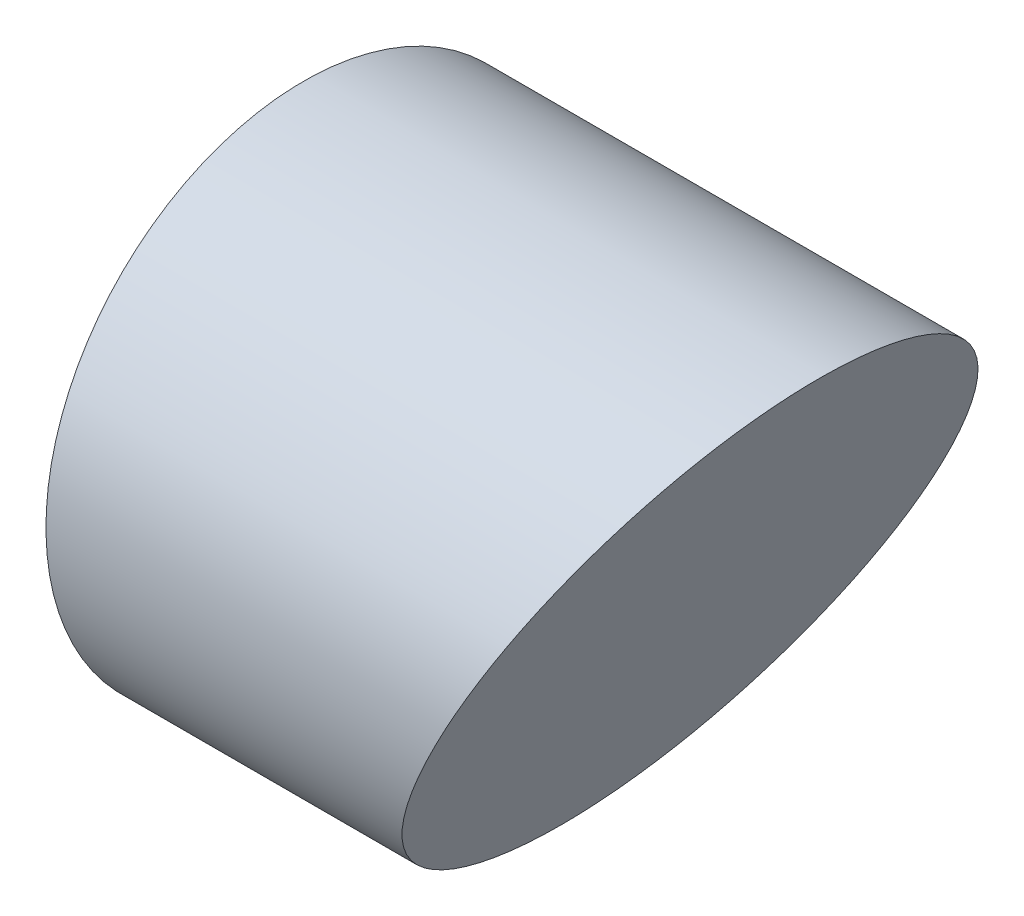
ISO-10303-21;
HEADER;
FILE_DESCRIPTION(('STEP AP214'),'2;1');
FILE_NAME('part.step','',(''),(''),'','','');
FILE_SCHEMA(('AUTOMOTIVE_DESIGN { 1 0 10303 214 1 1 1 1 }'));
ENDSEC;
DATA;
#1=APPLICATION_CONTEXT('core data for automotive mechanical design processes');
#2=APPLICATION_PROTOCOL_DEFINITION('international standard','automotive_design',2000,#1);
#3=PRODUCT_CONTEXT('',#1,'mechanical');
#4=PRODUCT('Part','Part','',(#3));
#5=PRODUCT_RELATED_PRODUCT_CATEGORY('part','',(#4));
#6=PRODUCT_DEFINITION_FORMATION('','',#4);
#7=PRODUCT_DEFINITION_CONTEXT('part definition',#1,'design');
#8=PRODUCT_DEFINITION('design','',#6,#7);
#9=PRODUCT_DEFINITION_SHAPE('','',#8);
#10=(LENGTH_UNIT() NAMED_UNIT(*) SI_UNIT(.MILLI.,.METRE.));
#11=(NAMED_UNIT(*) PLANE_ANGLE_UNIT() SI_UNIT($,.RADIAN.));
#12=(NAMED_UNIT(*) SI_UNIT($,.STERADIAN.) SOLID_ANGLE_UNIT());
#13=UNCERTAINTY_MEASURE_WITH_UNIT(LENGTH_MEASURE(1.E-05),#10,'distance_accuracy_value','');
#14=(GEOMETRIC_REPRESENTATION_CONTEXT(3) GLOBAL_UNCERTAINTY_ASSIGNED_CONTEXT((#13)) GLOBAL_UNIT_ASSIGNED_CONTEXT((#10,
#11,#12)) REPRESENTATION_CONTEXT('',''));
#15=CARTESIAN_POINT('',(0.,0.,0.));
#16=DIRECTION('',(0.,0.,1.));
#17=DIRECTION('',(1.,0.,0.));
#18=AXIS2_PLACEMENT_3D('',#15,#16,#17);
#19=CARTESIAN_POINT('',(0.,0.,127.));
#20=DIRECTION('',(1.,0.,0.));
#21=DIRECTION('',(0.,1.,0.));
#22=AXIS2_PLACEMENT_3D('',#19,#20,#21);
#23=PLANE('',#22);
#24=CARTESIAN_POINT('',(0.,-63.5,63.5));
#25=DIRECTION('',(-1.,0.,0.));
#26=DIRECTION('',(0.,-1.,0.));
#27=AXIS2_PLACEMENT_3D('',#24,#25,#26);
#28=CIRCLE('',#27,57.15);
#29=CARTESIAN_POINT('',(0.,-120.65,63.5));
#30=VERTEX_POINT('',#29);
#31=EDGE_CURVE('E70',#30,#30,#28,.T.);
#32=ORIENTED_EDGE('',*,*,#31,.F.);
#33=EDGE_LOOP('',(#32));
#34=FACE_BOUND('',#33,.T.);
#35=CARTESIAN_POINT('',(0.,-63.5,63.5));
#36=DIRECTION('',(-1.,0.,0.));
#37=DIRECTION('',(0.,-1.,0.));
#38=AXIS2_PLACEMENT_3D('',#35,#36,#37);
#39=CIRCLE('',#38,63.5);
#40=CARTESIAN_POINT('',(0.,-127.,63.5));
#41=VERTEX_POINT('',#40);
#42=EDGE_CURVE('E81',#41,#41,#39,.T.);
#43=ORIENTED_EDGE('',*,*,#42,.T.);
#44=EDGE_LOOP('',(#43));
#45=FACE_BOUND('',#44,.T.);
#46=ADVANCED_FACE('F67',(#34,#45),#23,.F.);
#47=CARTESIAN_POINT('',(127.,0.,127.));
#48=DIRECTION('',(-0.894427190999916,0.447213595499958,0.));
#49=DIRECTION('',(-0.447213595499958,-0.894427190999916,0.));
#50=AXIS2_PLACEMENT_3D('',#47,#48,#49);
#51=PLANE('',#50);
#52=CARTESIAN_POINT('',(95.25,-63.5,63.5));
#53=DIRECTION('',(-0.894427190999916,0.447213595499958,0.));
#54=DIRECTION('',(-0.447213595499958,-0.894427190999916,0.));
#55=AXIS2_PLACEMENT_3D('',#52,#53,#54);
#56=ELLIPSE('',#55,70.9951582856183,63.5);
#57=CARTESIAN_POINT('',(63.5,-127.,63.5));
#58=VERTEX_POINT('',#57);
#59=EDGE_CURVE('E77',#58,#58,#56,.T.);
#60=ORIENTED_EDGE('',*,*,#59,.F.);
#61=EDGE_LOOP('',(#60));
#62=FACE_BOUND('',#61,.T.);
#63=ADVANCED_FACE('F93',(#62),#51,.F.);
#64=CARTESIAN_POINT('',(61.9999999999999,-63.5,63.5));
#65=DIRECTION('',(-1.,0.,0.));
#66=DIRECTION('',(0.,-1.,0.));
#67=AXIS2_PLACEMENT_3D('',#64,#65,#66);
#68=CYLINDRICAL_SURFACE('',#67,57.15);
#69=CARTESIAN_POINT('',(61.9999999999999,-63.5,63.5));
#70=DIRECTION('',(-1.,0.,0.));
#71=DIRECTION('',(0.,-1.,0.));
#72=AXIS2_PLACEMENT_3D('',#69,#70,#71);
#73=CIRCLE('',#72,57.15);
#74=CARTESIAN_POINT('',(61.9999999999999,-120.65,63.5));
#75=VERTEX_POINT('',#74);
#76=EDGE_CURVE('E11',#75,#75,#73,.T.);
#77=ORIENTED_EDGE('',*,*,#76,.F.);
#78=EDGE_LOOP('',(#77));
#79=FACE_BOUND('',#78,.T.);
#80=ORIENTED_EDGE('',*,*,#31,.T.);
#81=EDGE_LOOP('',(#80));
#82=FACE_BOUND('',#81,.T.);
#83=ADVANCED_FACE('F95',(#79,#82),#68,.F.);
#84=CARTESIAN_POINT('',(61.9999999999999,-63.5,63.5));
#85=DIRECTION('',(-1.,0.,0.));
#86=DIRECTION('',(0.,-1.,0.));
#87=AXIS2_PLACEMENT_3D('',#84,#85,#86);
#88=PLANE('',#87);
#89=ORIENTED_EDGE('',*,*,#76,.T.);
#90=EDGE_LOOP('',(#89));
#91=FACE_BOUND('',#90,.T.);
#92=ADVANCED_FACE('F89',(#91),#88,.T.);
#93=CARTESIAN_POINT('',(127.,-63.5,63.5));
#94=DIRECTION('',(-1.,0.,0.));
#95=DIRECTION('',(0.,-1.,0.));
#96=AXIS2_PLACEMENT_3D('',#93,#94,#95);
#97=CYLINDRICAL_SURFACE('',#96,63.5);
#98=ORIENTED_EDGE('',*,*,#42,.F.);
#99=EDGE_LOOP('',(#98));
#100=FACE_BOUND('',#99,.T.);
#101=ORIENTED_EDGE('',*,*,#59,.T.);
#102=EDGE_LOOP('',(#101));
#103=FACE_BOUND('',#102,.T.);
#104=ADVANCED_FACE('F86',(#100,#103),#97,.T.);
#105=CLOSED_SHELL('',(#46,#63,#83,#92,#104));
#106=MANIFOLD_SOLID_BREP('B2',#105);
#107=ADVANCED_BREP_SHAPE_REPRESENTATION('',(#18,#106),#14);
#108=SHAPE_DEFINITION_REPRESENTATION(#9,#107);
ENDSEC;
END-ISO-10303-21;
